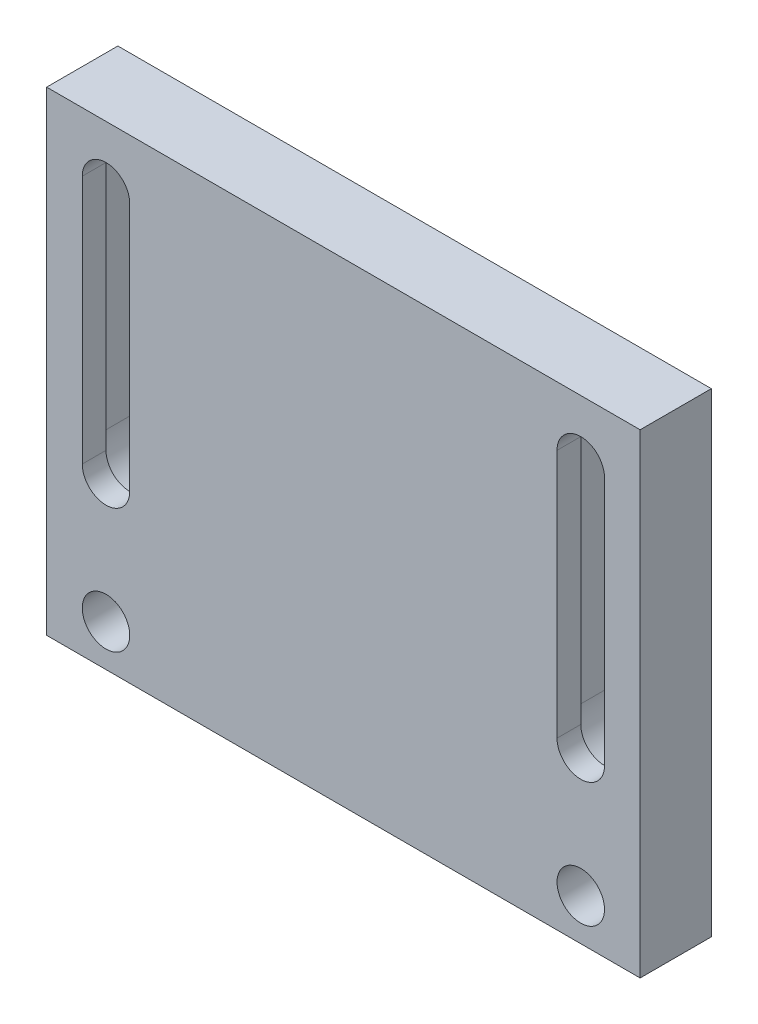
ISO-10303-21;
HEADER;
FILE_DESCRIPTION(('STEP AP214'),'2;1');
FILE_NAME('part.step','',(''),(''),'','','');
FILE_SCHEMA(('AUTOMOTIVE_DESIGN { 1 0 10303 214 1 1 1 1 }'));
ENDSEC;
DATA;
#1=APPLICATION_CONTEXT('core data for automotive mechanical design processes');
#2=APPLICATION_PROTOCOL_DEFINITION('international standard','automotive_design',2000,#1);
#3=PRODUCT_CONTEXT('',#1,'mechanical');
#4=PRODUCT('Part','Part','',(#3));
#5=PRODUCT_RELATED_PRODUCT_CATEGORY('part','',(#4));
#6=PRODUCT_DEFINITION_FORMATION('','',#4);
#7=PRODUCT_DEFINITION_CONTEXT('part definition',#1,'design');
#8=PRODUCT_DEFINITION('design','',#6,#7);
#9=PRODUCT_DEFINITION_SHAPE('','',#8);
#10=(LENGTH_UNIT() NAMED_UNIT(*) SI_UNIT(.MILLI.,.METRE.));
#11=(NAMED_UNIT(*) PLANE_ANGLE_UNIT() SI_UNIT($,.RADIAN.));
#12=(NAMED_UNIT(*) SI_UNIT($,.STERADIAN.) SOLID_ANGLE_UNIT());
#13=UNCERTAINTY_MEASURE_WITH_UNIT(LENGTH_MEASURE(1.E-05),#10,'distance_accuracy_value','');
#14=(GEOMETRIC_REPRESENTATION_CONTEXT(3) GLOBAL_UNCERTAINTY_ASSIGNED_CONTEXT((#13)) GLOBAL_UNIT_ASSIGNED_CONTEXT((#10,
#11,#12)) REPRESENTATION_CONTEXT('',''));
#15=CARTESIAN_POINT('',(0.,0.,0.));
#16=DIRECTION('',(0.,0.,1.));
#17=DIRECTION('',(1.,0.,0.));
#18=AXIS2_PLACEMENT_3D('',#15,#16,#17);
#19=CARTESIAN_POINT('',(25.,-20.,6.));
#20=DIRECTION('',(-1.,0.,0.));
#21=DIRECTION('',(0.,0.,1.));
#22=AXIS2_PLACEMENT_3D('',#19,#20,#21);
#23=PLANE('',#22);
#24=DIRECTION('',(0.,1.,0.));
#25=VECTOR('',#24,1.);
#26=CARTESIAN_POINT('',(25.,-20.,0.));
#27=LINE('',#26,#25);
#28=CARTESIAN_POINT('',(25.,-20.,0.));
#29=VERTEX_POINT('',#28);
#30=CARTESIAN_POINT('',(25.,20.,0.));
#31=VERTEX_POINT('',#30);
#32=EDGE_CURVE('E290',#29,#31,#27,.T.);
#33=ORIENTED_EDGE('',*,*,#32,.T.);
#34=DIRECTION('',(0.,0.,-1.));
#35=VECTOR('',#34,1.);
#36=CARTESIAN_POINT('',(25.,20.,6.));
#37=LINE('',#36,#35);
#38=CARTESIAN_POINT('',(25.,20.,6.));
#39=VERTEX_POINT('',#38);
#40=EDGE_CURVE('E379',#39,#31,#37,.T.);
#41=ORIENTED_EDGE('',*,*,#40,.F.);
#42=DIRECTION('',(0.,1.,0.));
#43=VECTOR('',#42,1.);
#44=CARTESIAN_POINT('',(25.,-20.,6.));
#45=LINE('',#44,#43);
#46=CARTESIAN_POINT('',(25.,-20.,6.));
#47=VERTEX_POINT('',#46);
#48=EDGE_CURVE('E342',#47,#39,#45,.T.);
#49=ORIENTED_EDGE('',*,*,#48,.F.);
#50=DIRECTION('',(0.,0.,-1.));
#51=VECTOR('',#50,1.);
#52=CARTESIAN_POINT('',(25.,-20.,6.));
#53=LINE('',#52,#51);
#54=EDGE_CURVE('E356',#47,#29,#53,.T.);
#55=ORIENTED_EDGE('',*,*,#54,.T.);
#56=EDGE_LOOP('',(#33,#41,#49,#55));
#57=FACE_BOUND('',#56,.T.);
#58=ADVANCED_FACE('F39',(#57),#23,.F.);
#59=CARTESIAN_POINT('',(-25.,20.,6.));
#60=DIRECTION('',(0.,-1.,0.));
#61=DIRECTION('',(0.,0.,-1.));
#62=AXIS2_PLACEMENT_3D('',#59,#60,#61);
#63=PLANE('',#62);
#64=DIRECTION('',(-1.,0.,0.));
#65=VECTOR('',#64,1.);
#66=CARTESIAN_POINT('',(-25.,20.,0.));
#67=LINE('',#66,#65);
#68=CARTESIAN_POINT('',(-25.,20.,0.));
#69=VERTEX_POINT('',#68);
#70=EDGE_CURVE('E360',#31,#69,#67,.T.);
#71=ORIENTED_EDGE('',*,*,#70,.T.);
#72=DIRECTION('',(0.,0.,-1.));
#73=VECTOR('',#72,1.);
#74=CARTESIAN_POINT('',(-25.,20.,6.));
#75=LINE('',#74,#73);
#76=CARTESIAN_POINT('',(-25.,20.,6.));
#77=VERTEX_POINT('',#76);
#78=EDGE_CURVE('E375',#77,#69,#75,.T.);
#79=ORIENTED_EDGE('',*,*,#78,.F.);
#80=DIRECTION('',(-1.,0.,0.));
#81=VECTOR('',#80,1.);
#82=CARTESIAN_POINT('',(-25.,20.,6.));
#83=LINE('',#82,#81);
#84=EDGE_CURVE('E346',#39,#77,#83,.T.);
#85=ORIENTED_EDGE('',*,*,#84,.F.);
#86=ORIENTED_EDGE('',*,*,#40,.T.);
#87=EDGE_LOOP('',(#71,#79,#85,#86));
#88=FACE_BOUND('',#87,.T.);
#89=ADVANCED_FACE('F426',(#88),#63,.F.);
#90=CARTESIAN_POINT('',(-25.,-20.,6.));
#91=DIRECTION('',(1.,0.,0.));
#92=DIRECTION('',(0.,0.,-1.));
#93=AXIS2_PLACEMENT_3D('',#90,#91,#92);
#94=PLANE('',#93);
#95=DIRECTION('',(0.,-1.,0.));
#96=VECTOR('',#95,1.);
#97=CARTESIAN_POINT('',(-25.,-20.,0.));
#98=LINE('',#97,#96);
#99=CARTESIAN_POINT('',(-25.,-20.,0.));
#100=VERTEX_POINT('',#99);
#101=EDGE_CURVE('E363',#69,#100,#98,.T.);
#102=ORIENTED_EDGE('',*,*,#101,.T.);
#103=DIRECTION('',(0.,0.,-1.));
#104=VECTOR('',#103,1.);
#105=CARTESIAN_POINT('',(-25.,-20.,6.));
#106=LINE('',#105,#104);
#107=CARTESIAN_POINT('',(-25.,-20.,6.));
#108=VERTEX_POINT('',#107);
#109=EDGE_CURVE('E371',#108,#100,#106,.T.);
#110=ORIENTED_EDGE('',*,*,#109,.F.);
#111=DIRECTION('',(0.,-1.,0.));
#112=VECTOR('',#111,1.);
#113=CARTESIAN_POINT('',(-25.,-20.,6.));
#114=LINE('',#113,#112);
#115=EDGE_CURVE('E350',#77,#108,#114,.T.);
#116=ORIENTED_EDGE('',*,*,#115,.F.);
#117=ORIENTED_EDGE('',*,*,#78,.T.);
#118=EDGE_LOOP('',(#102,#110,#116,#117));
#119=FACE_BOUND('',#118,.T.);
#120=ADVANCED_FACE('F431',(#119),#94,.F.);
#121=CARTESIAN_POINT('',(-25.,-20.,6.));
#122=DIRECTION('',(0.,1.,0.));
#123=DIRECTION('',(0.,0.,1.));
#124=AXIS2_PLACEMENT_3D('',#121,#122,#123);
#125=PLANE('',#124);
#126=DIRECTION('',(1.,0.,0.));
#127=VECTOR('',#126,1.);
#128=CARTESIAN_POINT('',(-25.,-20.,0.));
#129=LINE('',#128,#127);
#130=EDGE_CURVE('E347',#100,#29,#129,.T.);
#131=ORIENTED_EDGE('',*,*,#130,.T.);
#132=ORIENTED_EDGE('',*,*,#54,.F.);
#133=DIRECTION('',(1.,0.,0.));
#134=VECTOR('',#133,1.);
#135=CARTESIAN_POINT('',(-25.,-20.,6.));
#136=LINE('',#135,#134);
#137=EDGE_CURVE('E353',#108,#47,#136,.T.);
#138=ORIENTED_EDGE('',*,*,#137,.F.);
#139=ORIENTED_EDGE('',*,*,#109,.T.);
#140=EDGE_LOOP('',(#131,#132,#138,#139));
#141=FACE_BOUND('',#140,.T.);
#142=ADVANCED_FACE('F447',(#141),#125,.F.);
#143=CARTESIAN_POINT('',(0.,0.,6.));
#144=DIRECTION('',(0.,0.,-1.));
#145=DIRECTION('',(-1.,0.,0.));
#146=AXIS2_PLACEMENT_3D('',#143,#144,#145);
#147=PLANE('',#146);
#148=CARTESIAN_POINT('',(-20.,-16.5,6.));
#149=DIRECTION('',(0.,0.,-1.));
#150=DIRECTION('',(-1.,0.,0.));
#151=AXIS2_PLACEMENT_3D('',#148,#149,#150);
#152=CIRCLE('',#151,2.);
#153=CARTESIAN_POINT('',(-22.,-16.5,6.));
#154=VERTEX_POINT('',#153);
#155=EDGE_CURVE('E217',#154,#154,#152,.F.);
#156=ORIENTED_EDGE('',*,*,#155,.F.);
#157=EDGE_LOOP('',(#156));
#158=FACE_BOUND('',#157,.T.);
#159=DIRECTION('',(0.,-1.,0.));
#160=VECTOR('',#159,1.);
#161=CARTESIAN_POINT('',(18.,15.,6.));
#162=LINE('',#161,#160);
#163=CARTESIAN_POINT('',(18.,15.,6.));
#164=VERTEX_POINT('',#163);
#165=CARTESIAN_POINT('',(18.,-6.00000000000001,6.));
#166=VERTEX_POINT('',#165);
#167=EDGE_CURVE('E226',#164,#166,#162,.T.);
#168=ORIENTED_EDGE('',*,*,#167,.F.);
#169=CARTESIAN_POINT('',(20.,15.,6.));
#170=DIRECTION('',(0.,0.,-1.));
#171=DIRECTION('',(-1.,0.,0.));
#172=AXIS2_PLACEMENT_3D('',#169,#170,#171);
#173=CIRCLE('',#172,2.);
#174=CARTESIAN_POINT('',(22.,15.,6.));
#175=VERTEX_POINT('',#174);
#176=EDGE_CURVE('E230',#175,#164,#173,.F.);
#177=ORIENTED_EDGE('',*,*,#176,.F.);
#178=DIRECTION('',(0.,1.,0.));
#179=VECTOR('',#178,1.);
#180=CARTESIAN_POINT('',(22.,15.,6.));
#181=LINE('',#180,#179);
#182=CARTESIAN_POINT('',(22.,-6.00000000000001,6.));
#183=VERTEX_POINT('',#182);
#184=EDGE_CURVE('E218',#183,#175,#181,.T.);
#185=ORIENTED_EDGE('',*,*,#184,.F.);
#186=CARTESIAN_POINT('',(20.,-6.00000000000001,6.));
#187=DIRECTION('',(0.,0.,-1.));
#188=DIRECTION('',(-1.,0.,0.));
#189=AXIS2_PLACEMENT_3D('',#186,#187,#188);
#190=CIRCLE('',#189,2.);
#191=EDGE_CURVE('E223',#166,#183,#190,.F.);
#192=ORIENTED_EDGE('',*,*,#191,.F.);
#193=EDGE_LOOP('',(#168,#177,#185,#192));
#194=FACE_BOUND('',#193,.T.);
#195=DIRECTION('',(0.,1.,0.));
#196=VECTOR('',#195,1.);
#197=CARTESIAN_POINT('',(-18.,15.,6.));
#198=LINE('',#197,#196);
#199=CARTESIAN_POINT('',(-18.,-6.,6.));
#200=VERTEX_POINT('',#199);
#201=CARTESIAN_POINT('',(-18.,15.,6.));
#202=VERTEX_POINT('',#201);
#203=EDGE_CURVE('E196',#200,#202,#198,.T.);
#204=ORIENTED_EDGE('',*,*,#203,.F.);
#205=CARTESIAN_POINT('',(-20.,-6.00000000000001,6.));
#206=DIRECTION('',(0.,0.,-1.));
#207=DIRECTION('',(-1.,0.,0.));
#208=AXIS2_PLACEMENT_3D('',#205,#206,#207);
#209=CIRCLE('',#208,2.);
#210=CARTESIAN_POINT('',(-22.,-6.,6.));
#211=VERTEX_POINT('',#210);
#212=EDGE_CURVE('E183',#211,#200,#209,.F.);
#213=ORIENTED_EDGE('',*,*,#212,.F.);
#214=DIRECTION('',(0.,-1.,0.));
#215=VECTOR('',#214,1.);
#216=CARTESIAN_POINT('',(-22.,15.,6.));
#217=LINE('',#216,#215);
#218=CARTESIAN_POINT('',(-22.,15.,6.));
#219=VERTEX_POINT('',#218);
#220=EDGE_CURVE('E174',#219,#211,#217,.T.);
#221=ORIENTED_EDGE('',*,*,#220,.F.);
#222=CARTESIAN_POINT('',(-20.,15.,6.));
#223=DIRECTION('',(0.,0.,-1.));
#224=DIRECTION('',(-1.,0.,0.));
#225=AXIS2_PLACEMENT_3D('',#222,#223,#224);
#226=CIRCLE('',#225,2.);
#227=EDGE_CURVE('E200',#202,#219,#226,.F.);
#228=ORIENTED_EDGE('',*,*,#227,.F.);
#229=EDGE_LOOP('',(#204,#213,#221,#228));
#230=FACE_BOUND('',#229,.T.);
#231=CARTESIAN_POINT('',(20.,-16.5,6.));
#232=DIRECTION('',(0.,0.,-1.));
#233=DIRECTION('',(-1.,0.,0.));
#234=AXIS2_PLACEMENT_3D('',#231,#232,#233);
#235=CIRCLE('',#234,2.);
#236=CARTESIAN_POINT('',(18.,-16.5,6.));
#237=VERTEX_POINT('',#236);
#238=EDGE_CURVE('E249',#237,#237,#235,.F.);
#239=ORIENTED_EDGE('',*,*,#238,.F.);
#240=EDGE_LOOP('',(#239));
#241=FACE_BOUND('',#240,.T.);
#242=ORIENTED_EDGE('',*,*,#48,.T.);
#243=ORIENTED_EDGE('',*,*,#84,.T.);
#244=ORIENTED_EDGE('',*,*,#115,.T.);
#245=ORIENTED_EDGE('',*,*,#137,.T.);
#246=EDGE_LOOP('',(#242,#243,#244,#245));
#247=FACE_BOUND('',#246,.T.);
#248=ADVANCED_FACE('F194',(#158,#194,#230,#241,#247),#147,.F.);
#249=CARTESIAN_POINT('',(0.,0.,0.));
#250=DIRECTION('',(0.,0.,-1.));
#251=DIRECTION('',(-1.,0.,0.));
#252=AXIS2_PLACEMENT_3D('',#249,#250,#251);
#253=PLANE('',#252);
#254=CARTESIAN_POINT('',(-20.,-16.5,0.));
#255=DIRECTION('',(0.,0.,-1.));
#256=DIRECTION('',(1.,0.,0.));
#257=AXIS2_PLACEMENT_3D('',#254,#255,#256);
#258=CIRCLE('',#257,2.);
#259=CARTESIAN_POINT('',(-18.,-16.5,0.));
#260=VERTEX_POINT('',#259);
#261=EDGE_CURVE('E213',#260,#260,#258,.T.);
#262=ORIENTED_EDGE('',*,*,#261,.F.);
#263=EDGE_LOOP('',(#262));
#264=FACE_BOUND('',#263,.T.);
#265=CARTESIAN_POINT('',(20.,-16.5,0.));
#266=DIRECTION('',(0.,0.,-1.));
#267=DIRECTION('',(-1.,0.,0.));
#268=AXIS2_PLACEMENT_3D('',#265,#266,#267);
#269=CIRCLE('',#268,2.);
#270=CARTESIAN_POINT('',(18.,-16.5,0.));
#271=VERTEX_POINT('',#270);
#272=EDGE_CURVE('E222',#271,#271,#269,.T.);
#273=ORIENTED_EDGE('',*,*,#272,.F.);
#274=EDGE_LOOP('',(#273));
#275=FACE_BOUND('',#274,.T.);
#276=CARTESIAN_POINT('',(20.,15.,0.));
#277=DIRECTION('',(0.,0.,-1.));
#278=DIRECTION('',(1.,0.,0.));
#279=AXIS2_PLACEMENT_3D('',#276,#277,#278);
#280=CIRCLE('',#279,3.5);
#281=CARTESIAN_POINT('',(16.5,15.,0.));
#282=VERTEX_POINT('',#281);
#283=CARTESIAN_POINT('',(23.5,15.,0.));
#284=VERTEX_POINT('',#283);
#285=EDGE_CURVE('E272',#282,#284,#280,.T.);
#286=ORIENTED_EDGE('',*,*,#285,.F.);
#287=DIRECTION('',(0.,1.,0.));
#288=VECTOR('',#287,1.);
#289=CARTESIAN_POINT('',(16.5,15.,0.));
#290=LINE('',#289,#288);
#291=CARTESIAN_POINT('',(16.5,-6.00000000000001,0.));
#292=VERTEX_POINT('',#291);
#293=EDGE_CURVE('E259',#292,#282,#290,.T.);
#294=ORIENTED_EDGE('',*,*,#293,.F.);
#295=CARTESIAN_POINT('',(20.,-6.00000000000001,0.));
#296=DIRECTION('',(0.,0.,-1.));
#297=DIRECTION('',(-1.,0.,0.));
#298=AXIS2_PLACEMENT_3D('',#295,#296,#297);
#299=CIRCLE('',#298,3.5);
#300=CARTESIAN_POINT('',(23.5,-6.00000000000001,0.));
#301=VERTEX_POINT('',#300);
#302=EDGE_CURVE('E280',#301,#292,#299,.T.);
#303=ORIENTED_EDGE('',*,*,#302,.F.);
#304=DIRECTION('',(0.,-1.,0.));
#305=VECTOR('',#304,1.);
#306=CARTESIAN_POINT('',(23.5,15.,0.));
#307=LINE('',#306,#305);
#308=EDGE_CURVE('E275',#284,#301,#307,.T.);
#309=ORIENTED_EDGE('',*,*,#308,.F.);
#310=EDGE_LOOP('',(#286,#294,#303,#309));
#311=FACE_BOUND('',#310,.T.);
#312=CARTESIAN_POINT('',(-20.,15.,0.));
#313=DIRECTION('',(0.,0.,-1.));
#314=DIRECTION('',(-1.,0.,0.));
#315=AXIS2_PLACEMENT_3D('',#312,#313,#314);
#316=CIRCLE('',#315,3.5);
#317=CARTESIAN_POINT('',(-23.5,15.,0.));
#318=VERTEX_POINT('',#317);
#319=CARTESIAN_POINT('',(-16.5,15.,0.));
#320=VERTEX_POINT('',#319);
#321=EDGE_CURVE('E253',#318,#320,#316,.T.);
#322=ORIENTED_EDGE('',*,*,#321,.F.);
#323=DIRECTION('',(0.,1.,0.));
#324=VECTOR('',#323,1.);
#325=CARTESIAN_POINT('',(-23.5,15.,0.));
#326=LINE('',#325,#324);
#327=CARTESIAN_POINT('',(-23.5,-6.00000000000001,0.));
#328=VERTEX_POINT('',#327);
#329=EDGE_CURVE('E305',#328,#318,#326,.T.);
#330=ORIENTED_EDGE('',*,*,#329,.F.);
#331=CARTESIAN_POINT('',(-20.,-6.00000000000001,0.));
#332=DIRECTION('',(0.,0.,-1.));
#333=DIRECTION('',(1.,0.,0.));
#334=AXIS2_PLACEMENT_3D('',#331,#332,#333);
#335=CIRCLE('',#334,3.5);
#336=CARTESIAN_POINT('',(-16.5,-6.00000000000001,0.));
#337=VERTEX_POINT('',#336);
#338=EDGE_CURVE('E324',#337,#328,#335,.T.);
#339=ORIENTED_EDGE('',*,*,#338,.F.);
#340=DIRECTION('',(0.,-1.,0.));
#341=VECTOR('',#340,1.);
#342=CARTESIAN_POINT('',(-16.5,15.,0.));
#343=LINE('',#342,#341);
#344=EDGE_CURVE('E320',#320,#337,#343,.T.);
#345=ORIENTED_EDGE('',*,*,#344,.F.);
#346=EDGE_LOOP('',(#322,#330,#339,#345));
#347=FACE_BOUND('',#346,.T.);
#348=ORIENTED_EDGE('',*,*,#32,.F.);
#349=ORIENTED_EDGE('',*,*,#130,.F.);
#350=ORIENTED_EDGE('',*,*,#101,.F.);
#351=ORIENTED_EDGE('',*,*,#70,.F.);
#352=EDGE_LOOP('',(#348,#349,#350,#351));
#353=FACE_BOUND('',#352,.T.);
#354=ADVANCED_FACE('F439',(#264,#275,#311,#347,#353),#253,.T.);
#355=CARTESIAN_POINT('',(-20.,15.,4.));
#356=DIRECTION('',(0.,0.,-1.));
#357=DIRECTION('',(-1.,0.,0.));
#358=AXIS2_PLACEMENT_3D('',#355,#356,#357);
#359=CYLINDRICAL_SURFACE('',#358,3.5);
#360=ORIENTED_EDGE('',*,*,#321,.T.);
#361=DIRECTION('',(0.,0.,-1.));
#362=VECTOR('',#361,1.);
#363=CARTESIAN_POINT('',(-16.5,15.,4.));
#364=LINE('',#363,#362);
#365=CARTESIAN_POINT('',(-16.5,15.,4.));
#366=VERTEX_POINT('',#365);
#367=EDGE_CURVE('E317',#366,#320,#364,.T.);
#368=ORIENTED_EDGE('',*,*,#367,.F.);
#369=CARTESIAN_POINT('',(-20.,15.,4.));
#370=DIRECTION('',(0.,0.,-1.));
#371=DIRECTION('',(-1.,0.,0.));
#372=AXIS2_PLACEMENT_3D('',#369,#370,#371);
#373=CIRCLE('',#372,3.5);
#374=CARTESIAN_POINT('',(-23.5,15.,4.));
#375=VERTEX_POINT('',#374);
#376=EDGE_CURVE('E300',#375,#366,#373,.T.);
#377=ORIENTED_EDGE('',*,*,#376,.F.);
#378=DIRECTION('',(0.,0.,-1.));
#379=VECTOR('',#378,1.);
#380=CARTESIAN_POINT('',(-23.5,15.,4.));
#381=LINE('',#380,#379);
#382=EDGE_CURVE('E276',#375,#318,#381,.T.);
#383=ORIENTED_EDGE('',*,*,#382,.T.);
#384=EDGE_LOOP('',(#360,#368,#377,#383));
#385=FACE_BOUND('',#384,.T.);
#386=ADVANCED_FACE('F458',(#385),#359,.F.);
#387=CARTESIAN_POINT('',(-23.5,15.,4.));
#388=DIRECTION('',(-1.,0.,0.));
#389=DIRECTION('',(0.,0.,1.));
#390=AXIS2_PLACEMENT_3D('',#387,#388,#389);
#391=PLANE('',#390);
#392=ORIENTED_EDGE('',*,*,#329,.T.);
#393=ORIENTED_EDGE('',*,*,#382,.F.);
#394=DIRECTION('',(0.,1.,0.));
#395=VECTOR('',#394,1.);
#396=CARTESIAN_POINT('',(-23.5,15.,4.));
#397=LINE('',#396,#395);
#398=CARTESIAN_POINT('',(-23.5,-6.00000000000001,4.));
#399=VERTEX_POINT('',#398);
#400=EDGE_CURVE('E313',#399,#375,#397,.T.);
#401=ORIENTED_EDGE('',*,*,#400,.F.);
#402=DIRECTION('',(0.,0.,-1.));
#403=VECTOR('',#402,1.);
#404=CARTESIAN_POINT('',(-23.5,-6.00000000000001,4.));
#405=LINE('',#404,#403);
#406=EDGE_CURVE('E333',#399,#328,#405,.T.);
#407=ORIENTED_EDGE('',*,*,#406,.T.);
#408=EDGE_LOOP('',(#392,#393,#401,#407));
#409=FACE_BOUND('',#408,.T.);
#410=ADVANCED_FACE('F465',(#409),#391,.F.);
#411=CARTESIAN_POINT('',(-20.,-6.00000000000001,4.));
#412=DIRECTION('',(0.,0.,-1.));
#413=DIRECTION('',(-1.,0.,0.));
#414=AXIS2_PLACEMENT_3D('',#411,#412,#413);
#415=CYLINDRICAL_SURFACE('',#414,3.5);
#416=ORIENTED_EDGE('',*,*,#338,.T.);
#417=ORIENTED_EDGE('',*,*,#406,.F.);
#418=CARTESIAN_POINT('',(-20.,-6.00000000000001,4.));
#419=DIRECTION('',(0.,0.,-1.));
#420=DIRECTION('',(1.,0.,0.));
#421=AXIS2_PLACEMENT_3D('',#418,#419,#420);
#422=CIRCLE('',#421,3.5);
#423=CARTESIAN_POINT('',(-16.5,-6.00000000000001,4.));
#424=VERTEX_POINT('',#423);
#425=EDGE_CURVE('E309',#424,#399,#422,.T.);
#426=ORIENTED_EDGE('',*,*,#425,.F.);
#427=DIRECTION('',(0.,0.,-1.));
#428=VECTOR('',#427,1.);
#429=CARTESIAN_POINT('',(-16.5,-6.00000000000001,4.));
#430=LINE('',#429,#428);
#431=EDGE_CURVE('E336',#424,#337,#430,.T.);
#432=ORIENTED_EDGE('',*,*,#431,.T.);
#433=EDGE_LOOP('',(#416,#417,#426,#432));
#434=FACE_BOUND('',#433,.T.);
#435=ADVANCED_FACE('F470',(#434),#415,.F.);
#436=CARTESIAN_POINT('',(-16.5,15.,4.));
#437=DIRECTION('',(1.,0.,0.));
#438=DIRECTION('',(0.,1.,0.));
#439=AXIS2_PLACEMENT_3D('',#436,#437,#438);
#440=PLANE('',#439);
#441=ORIENTED_EDGE('',*,*,#344,.T.);
#442=ORIENTED_EDGE('',*,*,#431,.F.);
#443=DIRECTION('',(0.,-1.,0.));
#444=VECTOR('',#443,1.);
#445=CARTESIAN_POINT('',(-16.5,15.,4.));
#446=LINE('',#445,#444);
#447=EDGE_CURVE('E304',#366,#424,#446,.T.);
#448=ORIENTED_EDGE('',*,*,#447,.F.);
#449=ORIENTED_EDGE('',*,*,#367,.T.);
#450=EDGE_LOOP('',(#441,#442,#448,#449));
#451=FACE_BOUND('',#450,.T.);
#452=ADVANCED_FACE('F467',(#451),#440,.F.);
#453=CARTESIAN_POINT('',(-20.,15.,4.));
#454=DIRECTION('',(0.,0.,-1.));
#455=DIRECTION('',(-1.,0.,0.));
#456=AXIS2_PLACEMENT_3D('',#453,#454,#455);
#457=PLANE('',#456);
#458=CARTESIAN_POINT('',(-20.,-6.00000000000001,4.));
#459=DIRECTION('',(0.,0.,-1.));
#460=DIRECTION('',(-1.,0.,0.));
#461=AXIS2_PLACEMENT_3D('',#458,#459,#460);
#462=CIRCLE('',#461,2.);
#463=CARTESIAN_POINT('',(-18.,-6.00000000000001,4.));
#464=VERTEX_POINT('',#463);
#465=CARTESIAN_POINT('',(-22.,-6.,4.));
#466=VERTEX_POINT('',#465);
#467=EDGE_CURVE('E11',#464,#466,#462,.T.);
#468=ORIENTED_EDGE('',*,*,#467,.F.);
#469=DIRECTION('',(0.,-1.,0.));
#470=VECTOR('',#469,1.);
#471=CARTESIAN_POINT('',(-18.,15.,4.));
#472=LINE('',#471,#470);
#473=CARTESIAN_POINT('',(-18.,15.,4.));
#474=VERTEX_POINT('',#473);
#475=EDGE_CURVE('E47',#474,#464,#472,.T.);
#476=ORIENTED_EDGE('',*,*,#475,.F.);
#477=CARTESIAN_POINT('',(-20.,15.,4.));
#478=DIRECTION('',(0.,0.,-1.));
#479=DIRECTION('',(-1.,0.,0.));
#480=AXIS2_PLACEMENT_3D('',#477,#478,#479);
#481=CIRCLE('',#480,2.);
#482=CARTESIAN_POINT('',(-22.,15.,4.));
#483=VERTEX_POINT('',#482);
#484=EDGE_CURVE('E402',#483,#474,#481,.T.);
#485=ORIENTED_EDGE('',*,*,#484,.F.);
#486=DIRECTION('',(0.,1.,0.));
#487=VECTOR('',#486,1.);
#488=CARTESIAN_POINT('',(-22.,15.,4.));
#489=LINE('',#488,#487);
#490=EDGE_CURVE('E399',#466,#483,#489,.T.);
#491=ORIENTED_EDGE('',*,*,#490,.F.);
#492=EDGE_LOOP('',(#468,#476,#485,#491));
#493=FACE_BOUND('',#492,.T.);
#494=ORIENTED_EDGE('',*,*,#376,.T.);
#495=ORIENTED_EDGE('',*,*,#447,.T.);
#496=ORIENTED_EDGE('',*,*,#425,.T.);
#497=ORIENTED_EDGE('',*,*,#400,.T.);
#498=EDGE_LOOP('',(#494,#495,#496,#497));
#499=FACE_BOUND('',#498,.T.);
#500=ADVANCED_FACE('F411',(#493,#499),#457,.T.);
#501=CARTESIAN_POINT('',(20.,15.,4.));
#502=DIRECTION('',(0.,0.,-1.));
#503=DIRECTION('',(-1.,0.,0.));
#504=AXIS2_PLACEMENT_3D('',#501,#502,#503);
#505=CYLINDRICAL_SURFACE('',#504,3.5);
#506=ORIENTED_EDGE('',*,*,#285,.T.);
#507=DIRECTION('',(0.,0.,-1.));
#508=VECTOR('',#507,1.);
#509=CARTESIAN_POINT('',(23.5,15.,4.));
#510=LINE('',#509,#508);
#511=CARTESIAN_POINT('',(23.5,15.,4.));
#512=VERTEX_POINT('',#511);
#513=EDGE_CURVE('E271',#512,#284,#510,.T.);
#514=ORIENTED_EDGE('',*,*,#513,.F.);
#515=CARTESIAN_POINT('',(20.,15.,4.));
#516=DIRECTION('',(0.,0.,-1.));
#517=DIRECTION('',(1.,0.,0.));
#518=AXIS2_PLACEMENT_3D('',#515,#516,#517);
#519=CIRCLE('',#518,3.5);
#520=CARTESIAN_POINT('',(16.5,15.,4.));
#521=VERTEX_POINT('',#520);
#522=EDGE_CURVE('E254',#521,#512,#519,.T.);
#523=ORIENTED_EDGE('',*,*,#522,.F.);
#524=DIRECTION('',(0.,0.,-1.));
#525=VECTOR('',#524,1.);
#526=CARTESIAN_POINT('',(16.5,15.,4.));
#527=LINE('',#526,#525);
#528=EDGE_CURVE('E287',#521,#282,#527,.T.);
#529=ORIENTED_EDGE('',*,*,#528,.T.);
#530=EDGE_LOOP('',(#506,#514,#523,#529));
#531=FACE_BOUND('',#530,.T.);
#532=ADVANCED_FACE('F480',(#531),#505,.F.);
#533=CARTESIAN_POINT('',(16.5,15.,4.));
#534=DIRECTION('',(-1.,0.,0.));
#535=DIRECTION('',(0.,-1.,0.));
#536=AXIS2_PLACEMENT_3D('',#533,#534,#535);
#537=PLANE('',#536);
#538=ORIENTED_EDGE('',*,*,#293,.T.);
#539=ORIENTED_EDGE('',*,*,#528,.F.);
#540=DIRECTION('',(0.,1.,0.));
#541=VECTOR('',#540,1.);
#542=CARTESIAN_POINT('',(16.5,15.,4.));
#543=LINE('',#542,#541);
#544=CARTESIAN_POINT('',(16.5,-6.00000000000001,4.));
#545=VERTEX_POINT('',#544);
#546=EDGE_CURVE('E267',#545,#521,#543,.T.);
#547=ORIENTED_EDGE('',*,*,#546,.F.);
#548=DIRECTION('',(0.,0.,-1.));
#549=VECTOR('',#548,1.);
#550=CARTESIAN_POINT('',(16.5,-6.00000000000001,4.));
#551=LINE('',#550,#549);
#552=EDGE_CURVE('E291',#545,#292,#551,.T.);
#553=ORIENTED_EDGE('',*,*,#552,.T.);
#554=EDGE_LOOP('',(#538,#539,#547,#553));
#555=FACE_BOUND('',#554,.T.);
#556=ADVANCED_FACE('F483',(#555),#537,.F.);
#557=CARTESIAN_POINT('',(20.,-6.00000000000001,4.));
#558=DIRECTION('',(0.,0.,-1.));
#559=DIRECTION('',(-1.,0.,0.));
#560=AXIS2_PLACEMENT_3D('',#557,#558,#559);
#561=CYLINDRICAL_SURFACE('',#560,3.5);
#562=ORIENTED_EDGE('',*,*,#302,.T.);
#563=ORIENTED_EDGE('',*,*,#552,.F.);
#564=CARTESIAN_POINT('',(20.,-6.00000000000001,4.));
#565=DIRECTION('',(0.,0.,-1.));
#566=DIRECTION('',(-1.,0.,0.));
#567=AXIS2_PLACEMENT_3D('',#564,#565,#566);
#568=CIRCLE('',#567,3.5);
#569=CARTESIAN_POINT('',(23.5,-6.00000000000001,4.));
#570=VERTEX_POINT('',#569);
#571=EDGE_CURVE('E263',#570,#545,#568,.T.);
#572=ORIENTED_EDGE('',*,*,#571,.F.);
#573=DIRECTION('',(0.,0.,-1.));
#574=VECTOR('',#573,1.);
#575=CARTESIAN_POINT('',(23.5,-6.00000000000001,4.));
#576=LINE('',#575,#574);
#577=EDGE_CURVE('E294',#570,#301,#576,.T.);
#578=ORIENTED_EDGE('',*,*,#577,.T.);
#579=EDGE_LOOP('',(#562,#563,#572,#578));
#580=FACE_BOUND('',#579,.T.);
#581=ADVANCED_FACE('F489',(#580),#561,.F.);
#582=CARTESIAN_POINT('',(23.5,15.,4.));
#583=DIRECTION('',(1.,0.,0.));
#584=DIRECTION('',(0.,0.,-1.));
#585=AXIS2_PLACEMENT_3D('',#582,#583,#584);
#586=PLANE('',#585);
#587=ORIENTED_EDGE('',*,*,#308,.T.);
#588=ORIENTED_EDGE('',*,*,#577,.F.);
#589=DIRECTION('',(0.,-1.,0.));
#590=VECTOR('',#589,1.);
#591=CARTESIAN_POINT('',(23.5,15.,4.));
#592=LINE('',#591,#590);
#593=EDGE_CURVE('E258',#512,#570,#592,.T.);
#594=ORIENTED_EDGE('',*,*,#593,.F.);
#595=ORIENTED_EDGE('',*,*,#513,.T.);
#596=EDGE_LOOP('',(#587,#588,#594,#595));
#597=FACE_BOUND('',#596,.T.);
#598=ADVANCED_FACE('F485',(#597),#586,.F.);
#599=CARTESIAN_POINT('',(20.,15.,4.));
#600=DIRECTION('',(0.,0.,1.));
#601=DIRECTION('',(1.,0.,0.));
#602=AXIS2_PLACEMENT_3D('',#599,#600,#601);
#603=PLANE('',#602);
#604=DIRECTION('',(0.,1.,0.));
#605=VECTOR('',#604,1.);
#606=CARTESIAN_POINT('',(22.,15.,4.));
#607=LINE('',#606,#605);
#608=CARTESIAN_POINT('',(22.,-6.00000000000001,4.));
#609=VERTEX_POINT('',#608);
#610=CARTESIAN_POINT('',(22.,15.,4.));
#611=VERTEX_POINT('',#610);
#612=EDGE_CURVE('E383',#609,#611,#607,.T.);
#613=ORIENTED_EDGE('',*,*,#612,.T.);
#614=CARTESIAN_POINT('',(20.,15.,4.));
#615=DIRECTION('',(0.,0.,1.));
#616=DIRECTION('',(1.,0.,0.));
#617=AXIS2_PLACEMENT_3D('',#614,#615,#616);
#618=CIRCLE('',#617,2.);
#619=CARTESIAN_POINT('',(18.,15.,4.));
#620=VERTEX_POINT('',#619);
#621=EDGE_CURVE('E395',#611,#620,#618,.T.);
#622=ORIENTED_EDGE('',*,*,#621,.T.);
#623=DIRECTION('',(0.,-1.,0.));
#624=VECTOR('',#623,1.);
#625=CARTESIAN_POINT('',(18.,15.,4.));
#626=LINE('',#625,#624);
#627=CARTESIAN_POINT('',(18.,-6.00000000000001,4.));
#628=VERTEX_POINT('',#627);
#629=EDGE_CURVE('E391',#620,#628,#626,.T.);
#630=ORIENTED_EDGE('',*,*,#629,.T.);
#631=CARTESIAN_POINT('',(20.,-6.00000000000001,4.));
#632=DIRECTION('',(0.,0.,1.));
#633=DIRECTION('',(1.,0.,0.));
#634=AXIS2_PLACEMENT_3D('',#631,#632,#633);
#635=CIRCLE('',#634,2.);
#636=EDGE_CURVE('E387',#628,#609,#635,.T.);
#637=ORIENTED_EDGE('',*,*,#636,.T.);
#638=EDGE_LOOP('',(#613,#622,#630,#637));
#639=FACE_BOUND('',#638,.T.);
#640=ORIENTED_EDGE('',*,*,#522,.T.);
#641=ORIENTED_EDGE('',*,*,#593,.T.);
#642=ORIENTED_EDGE('',*,*,#571,.T.);
#643=ORIENTED_EDGE('',*,*,#546,.T.);
#644=EDGE_LOOP('',(#640,#641,#642,#643));
#645=FACE_BOUND('',#644,.T.);
#646=ADVANCED_FACE('F488',(#639,#645),#603,.F.);
#647=CARTESIAN_POINT('',(20.,15.,31.3179778023443));
#648=DIRECTION('',(0.,0.,-1.));
#649=DIRECTION('',(-1.,0.,0.));
#650=AXIS2_PLACEMENT_3D('',#647,#648,#649);
#651=CYLINDRICAL_SURFACE('',#650,2.);
#652=DIRECTION('',(0.,0.,-1.));
#653=VECTOR('',#652,1.);
#654=CARTESIAN_POINT('',(22.,15.,31.3179778023443));
#655=LINE('',#654,#653);
#656=EDGE_CURVE('E182',#175,#611,#655,.T.);
#657=ORIENTED_EDGE('',*,*,#656,.F.);
#658=ORIENTED_EDGE('',*,*,#176,.T.);
#659=DIRECTION('',(0.,0.,-1.));
#660=VECTOR('',#659,1.);
#661=CARTESIAN_POINT('',(18.,15.,31.3179778023443));
#662=LINE('',#661,#660);
#663=EDGE_CURVE('E227',#164,#620,#662,.T.);
#664=ORIENTED_EDGE('',*,*,#663,.T.);
#665=ORIENTED_EDGE('',*,*,#621,.F.);
#666=EDGE_LOOP('',(#657,#658,#664,#665));
#667=FACE_BOUND('',#666,.T.);
#668=ADVANCED_FACE('F499',(#667),#651,.F.);
#669=CARTESIAN_POINT('',(18.,15.,31.3179778023443));
#670=DIRECTION('',(-1.,0.,0.));
#671=DIRECTION('',(0.,-1.,0.));
#672=AXIS2_PLACEMENT_3D('',#669,#670,#671);
#673=PLANE('',#672);
#674=ORIENTED_EDGE('',*,*,#663,.F.);
#675=ORIENTED_EDGE('',*,*,#167,.T.);
#676=DIRECTION('',(0.,0.,-1.));
#677=VECTOR('',#676,1.);
#678=CARTESIAN_POINT('',(18.,-6.00000000000001,31.3179778023443));
#679=LINE('',#678,#677);
#680=EDGE_CURVE('E236',#166,#628,#679,.T.);
#681=ORIENTED_EDGE('',*,*,#680,.T.);
#682=ORIENTED_EDGE('',*,*,#629,.F.);
#683=EDGE_LOOP('',(#674,#675,#681,#682));
#684=FACE_BOUND('',#683,.T.);
#685=ADVANCED_FACE('F507',(#684),#673,.F.);
#686=CARTESIAN_POINT('',(20.,-6.00000000000001,31.3179778023443));
#687=DIRECTION('',(0.,0.,-1.));
#688=DIRECTION('',(-1.,0.,0.));
#689=AXIS2_PLACEMENT_3D('',#686,#687,#688);
#690=CYLINDRICAL_SURFACE('',#689,2.);
#691=ORIENTED_EDGE('',*,*,#680,.F.);
#692=ORIENTED_EDGE('',*,*,#191,.T.);
#693=DIRECTION('',(0.,0.,-1.));
#694=VECTOR('',#693,1.);
#695=CARTESIAN_POINT('',(22.,-6.00000000000001,31.3179778023443));
#696=LINE('',#695,#694);
#697=EDGE_CURVE('E54',#183,#609,#696,.T.);
#698=ORIENTED_EDGE('',*,*,#697,.T.);
#699=ORIENTED_EDGE('',*,*,#636,.F.);
#700=EDGE_LOOP('',(#691,#692,#698,#699));
#701=FACE_BOUND('',#700,.T.);
#702=ADVANCED_FACE('F512',(#701),#690,.F.);
#703=CARTESIAN_POINT('',(22.,15.,31.3179778023443));
#704=DIRECTION('',(1.,0.,0.));
#705=DIRECTION('',(0.,0.,-1.));
#706=AXIS2_PLACEMENT_3D('',#703,#704,#705);
#707=PLANE('',#706);
#708=ORIENTED_EDGE('',*,*,#697,.F.);
#709=ORIENTED_EDGE('',*,*,#184,.T.);
#710=ORIENTED_EDGE('',*,*,#656,.T.);
#711=ORIENTED_EDGE('',*,*,#612,.F.);
#712=EDGE_LOOP('',(#708,#709,#710,#711));
#713=FACE_BOUND('',#712,.T.);
#714=ADVANCED_FACE('F509',(#713),#707,.F.);
#715=CARTESIAN_POINT('',(-20.,-6.00000000000001,31.3179778023443));
#716=DIRECTION('',(0.,0.,-1.));
#717=DIRECTION('',(-1.,0.,0.));
#718=AXIS2_PLACEMENT_3D('',#715,#716,#717);
#719=CYLINDRICAL_SURFACE('',#718,2.);
#720=ORIENTED_EDGE('',*,*,#467,.T.);
#721=DIRECTION('',(0.,0.,-1.));
#722=VECTOR('',#721,1.);
#723=CARTESIAN_POINT('',(-22.,-6.00000000000001,31.3179778023443));
#724=LINE('',#723,#722);
#725=EDGE_CURVE('E177',#211,#466,#724,.T.);
#726=ORIENTED_EDGE('',*,*,#725,.F.);
#727=ORIENTED_EDGE('',*,*,#212,.T.);
#728=DIRECTION('',(0.,0.,-1.));
#729=VECTOR('',#728,1.);
#730=CARTESIAN_POINT('',(-18.,-6.00000000000001,31.3179778023443));
#731=LINE('',#730,#729);
#732=EDGE_CURVE('E204',#200,#464,#731,.T.);
#733=ORIENTED_EDGE('',*,*,#732,.T.);
#734=EDGE_LOOP('',(#720,#726,#727,#733));
#735=FACE_BOUND('',#734,.T.);
#736=ADVANCED_FACE('F186',(#735),#719,.F.);
#737=CARTESIAN_POINT('',(-18.,15.,31.3179778023443));
#738=DIRECTION('',(1.,0.,0.));
#739=DIRECTION('',(0.,1.,0.));
#740=AXIS2_PLACEMENT_3D('',#737,#738,#739);
#741=PLANE('',#740);
#742=ORIENTED_EDGE('',*,*,#475,.T.);
#743=ORIENTED_EDGE('',*,*,#732,.F.);
#744=ORIENTED_EDGE('',*,*,#203,.T.);
#745=DIRECTION('',(0.,0.,-1.));
#746=VECTOR('',#745,1.);
#747=CARTESIAN_POINT('',(-18.,15.,31.3179778023443));
#748=LINE('',#747,#746);
#749=EDGE_CURVE('E207',#202,#474,#748,.T.);
#750=ORIENTED_EDGE('',*,*,#749,.T.);
#751=EDGE_LOOP('',(#742,#743,#744,#750));
#752=FACE_BOUND('',#751,.T.);
#753=ADVANCED_FACE('F407',(#752),#741,.F.);
#754=CARTESIAN_POINT('',(-20.,15.,31.3179778023443));
#755=DIRECTION('',(0.,0.,-1.));
#756=DIRECTION('',(-1.,0.,0.));
#757=AXIS2_PLACEMENT_3D('',#754,#755,#756);
#758=CYLINDRICAL_SURFACE('',#757,2.);
#759=ORIENTED_EDGE('',*,*,#484,.T.);
#760=ORIENTED_EDGE('',*,*,#749,.F.);
#761=ORIENTED_EDGE('',*,*,#227,.T.);
#762=DIRECTION('',(0.,0.,-1.));
#763=VECTOR('',#762,1.);
#764=CARTESIAN_POINT('',(-22.,15.,31.3179778023443));
#765=LINE('',#764,#763);
#766=EDGE_CURVE('E62',#219,#483,#765,.T.);
#767=ORIENTED_EDGE('',*,*,#766,.T.);
#768=EDGE_LOOP('',(#759,#760,#761,#767));
#769=FACE_BOUND('',#768,.T.);
#770=ADVANCED_FACE('F414',(#769),#758,.F.);
#771=CARTESIAN_POINT('',(-22.,15.,31.3179778023443));
#772=DIRECTION('',(-1.,0.,0.));
#773=DIRECTION('',(0.,0.,1.));
#774=AXIS2_PLACEMENT_3D('',#771,#772,#773);
#775=PLANE('',#774);
#776=ORIENTED_EDGE('',*,*,#490,.T.);
#777=ORIENTED_EDGE('',*,*,#766,.F.);
#778=ORIENTED_EDGE('',*,*,#220,.T.);
#779=ORIENTED_EDGE('',*,*,#725,.T.);
#780=EDGE_LOOP('',(#776,#777,#778,#779));
#781=FACE_BOUND('',#780,.T.);
#782=ADVANCED_FACE('F176',(#781),#775,.F.);
#783=CARTESIAN_POINT('',(20.,-16.5,31.3179778023443));
#784=DIRECTION('',(0.,0.,-1.));
#785=DIRECTION('',(-1.,0.,0.));
#786=AXIS2_PLACEMENT_3D('',#783,#784,#785);
#787=CYLINDRICAL_SURFACE('',#786,2.);
#788=ORIENTED_EDGE('',*,*,#238,.T.);
#789=EDGE_LOOP('',(#788));
#790=FACE_BOUND('',#789,.T.);
#791=ORIENTED_EDGE('',*,*,#272,.T.);
#792=EDGE_LOOP('',(#791));
#793=FACE_BOUND('',#792,.T.);
#794=ADVANCED_FACE('F422',(#790,#793),#787,.F.);
#795=CARTESIAN_POINT('',(-20.,-16.5,31.3179778023443));
#796=DIRECTION('',(0.,0.,-1.));
#797=DIRECTION('',(-1.,0.,0.));
#798=AXIS2_PLACEMENT_3D('',#795,#796,#797);
#799=CYLINDRICAL_SURFACE('',#798,2.);
#800=ORIENTED_EDGE('',*,*,#155,.T.);
#801=EDGE_LOOP('',(#800));
#802=FACE_BOUND('',#801,.T.);
#803=ORIENTED_EDGE('',*,*,#261,.T.);
#804=EDGE_LOOP('',(#803));
#805=FACE_BOUND('',#804,.T.);
#806=ADVANCED_FACE('F503',(#802,#805),#799,.F.);
#807=CLOSED_SHELL('',(#58,#89,#120,#142,#248,#354,#386,#410,#435,#452,#500,#532,#556,#581,#598,
#646,#668,#685,#702,#714,#736,#753,#770,#782,#794,#806));
#808=MANIFOLD_SOLID_BREP('B2',#807);
#809=ADVANCED_BREP_SHAPE_REPRESENTATION('',(#18,#808),#14);
#810=SHAPE_DEFINITION_REPRESENTATION(#9,#809);
ENDSEC;
END-ISO-10303-21;
